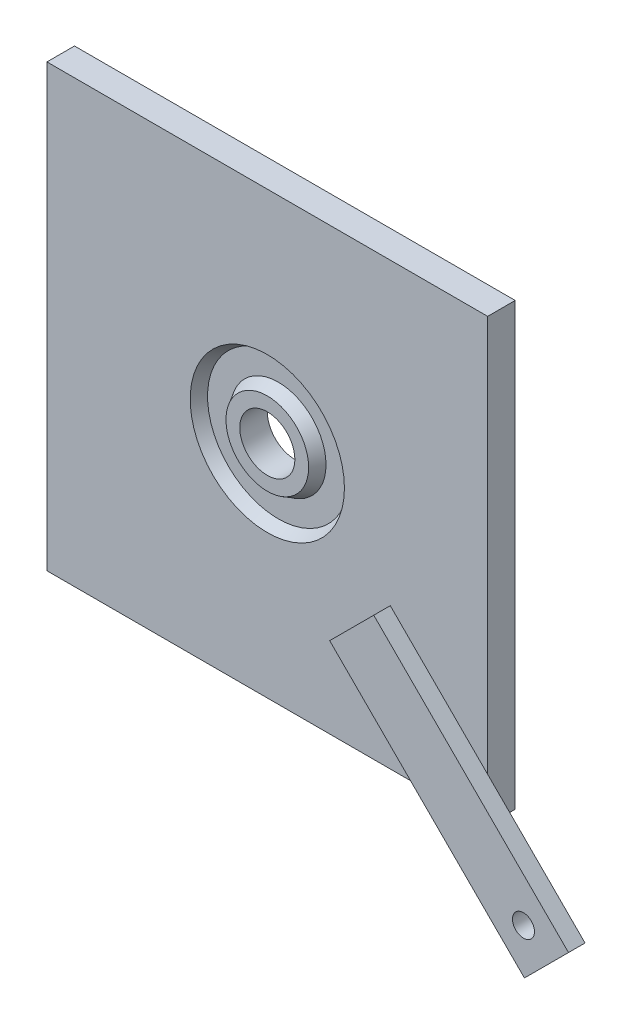
ISO-10303-21;
HEADER;
FILE_DESCRIPTION(('STEP AP214'),'2;1');
FILE_NAME('part.step','',(''),(''),'','','');
FILE_SCHEMA(('AUTOMOTIVE_DESIGN { 1 0 10303 214 1 1 1 1 }'));
ENDSEC;
DATA;
#1=APPLICATION_CONTEXT('core data for automotive mechanical design processes');
#2=APPLICATION_PROTOCOL_DEFINITION('international standard','automotive_design',2000,#1);
#3=PRODUCT_CONTEXT('',#1,'mechanical');
#4=PRODUCT('Part','Part','',(#3));
#5=PRODUCT_RELATED_PRODUCT_CATEGORY('part','',(#4));
#6=PRODUCT_DEFINITION_FORMATION('','',#4);
#7=PRODUCT_DEFINITION_CONTEXT('part definition',#1,'design');
#8=PRODUCT_DEFINITION('design','',#6,#7);
#9=PRODUCT_DEFINITION_SHAPE('','',#8);
#10=(LENGTH_UNIT() NAMED_UNIT(*) SI_UNIT(.MILLI.,.METRE.));
#11=(NAMED_UNIT(*) PLANE_ANGLE_UNIT() SI_UNIT($,.RADIAN.));
#12=(NAMED_UNIT(*) SI_UNIT($,.STERADIAN.) SOLID_ANGLE_UNIT());
#13=UNCERTAINTY_MEASURE_WITH_UNIT(LENGTH_MEASURE(1.E-05),#10,'distance_accuracy_value','');
#14=(GEOMETRIC_REPRESENTATION_CONTEXT(3) GLOBAL_UNCERTAINTY_ASSIGNED_CONTEXT((#13)) GLOBAL_UNIT_ASSIGNED_CONTEXT((#10,
#11,#12)) REPRESENTATION_CONTEXT('',''));
#15=CARTESIAN_POINT('',(0.,0.,0.));
#16=DIRECTION('',(0.,0.,1.));
#17=DIRECTION('',(1.,0.,0.));
#18=AXIS2_PLACEMENT_3D('',#15,#16,#17);
#19=CARTESIAN_POINT('',(0.,0.,5.));
#20=DIRECTION('',(0.,0.,-1.));
#21=DIRECTION('',(-1.,0.,0.));
#22=AXIS2_PLACEMENT_3D('',#19,#20,#21);
#23=PLANE('',#22);
#24=CARTESIAN_POINT('',(0.,0.,5.));
#25=DIRECTION('',(0.,0.,1.));
#26=DIRECTION('',(1.,0.,0.));
#27=AXIS2_PLACEMENT_3D('',#24,#25,#26);
#28=CIRCLE('',#27,14.);
#29=CARTESIAN_POINT('',(14.,0.,5.));
#30=VERTEX_POINT('',#29);
#31=EDGE_CURVE('E146',#30,#30,#28,.T.);
#32=ORIENTED_EDGE('',*,*,#31,.F.);
#33=EDGE_LOOP('',(#32));
#34=FACE_BOUND('',#33,.T.);
#35=DIRECTION('',(-0.707106781186552,0.707106781186543,0.));
#36=VECTOR('',#35,1.);
#37=CARTESIAN_POINT('',(57.6776695296637,-49.6776695296636,5.));
#38=LINE('',#37,#36);
#39=CARTESIAN_POINT('',(40.,-32.0000000000001,5.));
#40=VERTEX_POINT('',#39);
#41=CARTESIAN_POINT('',(22.3223304703361,-14.3223304703365,5.));
#42=VERTEX_POINT('',#41);
#43=EDGE_CURVE('E11',#40,#42,#38,.T.);
#44=ORIENTED_EDGE('',*,*,#43,.F.);
#45=DIRECTION('',(0.,1.,0.));
#46=VECTOR('',#45,1.);
#47=CARTESIAN_POINT('',(40.,-40.,5.));
#48=LINE('',#47,#46);
#49=CARTESIAN_POINT('',(40.,40.,5.));
#50=VERTEX_POINT('',#49);
#51=EDGE_CURVE('E171',#40,#50,#48,.T.);
#52=ORIENTED_EDGE('',*,*,#51,.T.);
#53=DIRECTION('',(-1.,0.,0.));
#54=VECTOR('',#53,1.);
#55=CARTESIAN_POINT('',(-40.,40.,5.));
#56=LINE('',#55,#54);
#57=CARTESIAN_POINT('',(-40.,40.,5.));
#58=VERTEX_POINT('',#57);
#59=EDGE_CURVE('E170',#50,#58,#56,.T.);
#60=ORIENTED_EDGE('',*,*,#59,.T.);
#61=DIRECTION('',(0.,-1.,0.));
#62=VECTOR('',#61,1.);
#63=CARTESIAN_POINT('',(-40.,-40.,5.));
#64=LINE('',#63,#62);
#65=CARTESIAN_POINT('',(-40.,-40.,5.));
#66=VERTEX_POINT('',#65);
#67=EDGE_CURVE('E174',#58,#66,#64,.T.);
#68=ORIENTED_EDGE('',*,*,#67,.T.);
#69=DIRECTION('',(1.,0.,0.));
#70=VECTOR('',#69,1.);
#71=CARTESIAN_POINT('',(-40.,-40.,5.));
#72=LINE('',#71,#70);
#73=CARTESIAN_POINT('',(32.,-40.,5.));
#74=VERTEX_POINT('',#73);
#75=EDGE_CURVE('E178',#66,#74,#72,.T.);
#76=ORIENTED_EDGE('',*,*,#75,.T.);
#77=DIRECTION('',(0.707106781186552,-0.707106781186543,0.));
#78=VECTOR('',#77,1.);
#79=CARTESIAN_POINT('',(49.6776695296638,-57.6776695296636,5.));
#80=LINE('',#79,#78);
#81=CARTESIAN_POINT('',(14.3223304703362,-22.3223304703365,5.));
#82=VERTEX_POINT('',#81);
#83=EDGE_CURVE('E61',#82,#74,#80,.T.);
#84=ORIENTED_EDGE('',*,*,#83,.F.);
#85=DIRECTION('',(-0.707106781186543,-0.707106781186552,0.));
#86=VECTOR('',#85,1.);
#87=CARTESIAN_POINT('',(14.3223304703362,-22.3223304703365,5.));
#88=LINE('',#87,#86);
#89=EDGE_CURVE('E57',#42,#82,#88,.T.);
#90=ORIENTED_EDGE('',*,*,#89,.F.);
#91=EDGE_LOOP('',(#44,#52,#60,#68,#76,#84,#90));
#92=FACE_BOUND('',#91,.T.);
#93=ADVANCED_FACE('F39',(#34,#92),#23,.F.);
#94=CARTESIAN_POINT('',(0.,0.,5.));
#95=DIRECTION('',(0.,0.,1.));
#96=DIRECTION('',(1.,0.,0.));
#97=AXIS2_PLACEMENT_3D('',#94,#95,#96);
#98=CIRCLE('',#97,5.);
#99=CARTESIAN_POINT('',(4.99999999999999,0.,5.));
#100=VERTEX_POINT('',#99);
#101=EDGE_CURVE('E158',#100,#100,#98,.T.);
#102=ORIENTED_EDGE('',*,*,#101,.F.);
#103=EDGE_LOOP('',(#102));
#104=FACE_BOUND('',#103,.T.);
#105=CARTESIAN_POINT('',(0.,0.,5.));
#106=DIRECTION('',(0.,0.,1.));
#107=DIRECTION('',(1.,0.,0.));
#108=AXIS2_PLACEMENT_3D('',#105,#106,#107);
#109=CIRCLE('',#108,7.5);
#110=CARTESIAN_POINT('',(7.5,0.,5.));
#111=VERTEX_POINT('',#110);
#112=EDGE_CURVE('E135',#111,#111,#109,.T.);
#113=ORIENTED_EDGE('',*,*,#112,.T.);
#114=EDGE_LOOP('',(#113));
#115=FACE_BOUND('',#114,.T.);
#116=ADVANCED_FACE('F284',(#104,#115),#23,.F.);
#117=CARTESIAN_POINT('',(0.,0.,0.));
#118=DIRECTION('',(0.,0.,-1.));
#119=DIRECTION('',(-1.,0.,0.));
#120=AXIS2_PLACEMENT_3D('',#117,#118,#119);
#121=PLANE('',#120);
#122=DIRECTION('',(0.,1.,0.));
#123=VECTOR('',#122,1.);
#124=CARTESIAN_POINT('',(40.,-40.,0.));
#125=LINE('',#124,#123);
#126=CARTESIAN_POINT('',(40.,-40.,0.));
#127=VERTEX_POINT('',#126);
#128=CARTESIAN_POINT('',(40.,40.,0.));
#129=VERTEX_POINT('',#128);
#130=EDGE_CURVE('E162',#127,#129,#125,.T.);
#131=ORIENTED_EDGE('',*,*,#130,.F.);
#132=DIRECTION('',(1.,0.,0.));
#133=VECTOR('',#132,1.);
#134=CARTESIAN_POINT('',(-40.,-40.,0.));
#135=LINE('',#134,#133);
#136=CARTESIAN_POINT('',(-40.,-40.,0.));
#137=VERTEX_POINT('',#136);
#138=EDGE_CURVE('E191',#137,#127,#135,.T.);
#139=ORIENTED_EDGE('',*,*,#138,.F.);
#140=DIRECTION('',(0.,-1.,0.));
#141=VECTOR('',#140,1.);
#142=CARTESIAN_POINT('',(-40.,-40.,0.));
#143=LINE('',#142,#141);
#144=CARTESIAN_POINT('',(-40.,40.,0.));
#145=VERTEX_POINT('',#144);
#146=EDGE_CURVE('E188',#145,#137,#143,.T.);
#147=ORIENTED_EDGE('',*,*,#146,.F.);
#148=DIRECTION('',(-1.,0.,0.));
#149=VECTOR('',#148,1.);
#150=CARTESIAN_POINT('',(-40.,40.,0.));
#151=LINE('',#150,#149);
#152=EDGE_CURVE('E185',#129,#145,#151,.T.);
#153=ORIENTED_EDGE('',*,*,#152,.F.);
#154=EDGE_LOOP('',(#131,#139,#147,#153));
#155=FACE_BOUND('',#154,.T.);
#156=CARTESIAN_POINT('',(0.,0.,0.));
#157=DIRECTION('',(0.,0.,1.));
#158=DIRECTION('',(1.,0.,0.));
#159=AXIS2_PLACEMENT_3D('',#156,#157,#158);
#160=CIRCLE('',#159,5.);
#161=CARTESIAN_POINT('',(4.99999999999999,0.,0.));
#162=VERTEX_POINT('',#161);
#163=EDGE_CURVE('E157',#162,#162,#160,.T.);
#164=ORIENTED_EDGE('',*,*,#163,.T.);
#165=EDGE_LOOP('',(#164));
#166=FACE_BOUND('',#165,.T.);
#167=ADVANCED_FACE('F219',(#155,#166),#121,.T.);
#168=CARTESIAN_POINT('',(40.,-40.,5.));
#169=DIRECTION('',(-1.,0.,0.));
#170=DIRECTION('',(0.,0.,1.));
#171=AXIS2_PLACEMENT_3D('',#168,#169,#170);
#172=PLANE('',#171);
#173=ORIENTED_EDGE('',*,*,#130,.T.);
#174=DIRECTION('',(0.,0.,-1.));
#175=VECTOR('',#174,1.);
#176=CARTESIAN_POINT('',(40.,40.,5.));
#177=LINE('',#176,#175);
#178=EDGE_CURVE('E43',#50,#129,#177,.T.);
#179=ORIENTED_EDGE('',*,*,#178,.F.);
#180=ORIENTED_EDGE('',*,*,#51,.F.);
#181=CARTESIAN_POINT('',(40.,-40.,5.));
#182=VERTEX_POINT('',#181);
#183=EDGE_CURVE('E166',#182,#40,#48,.T.);
#184=ORIENTED_EDGE('',*,*,#183,.F.);
#185=DIRECTION('',(0.,0.,-1.));
#186=VECTOR('',#185,1.);
#187=CARTESIAN_POINT('',(40.,-40.,5.));
#188=LINE('',#187,#186);
#189=EDGE_CURVE('E181',#182,#127,#188,.T.);
#190=ORIENTED_EDGE('',*,*,#189,.T.);
#191=EDGE_LOOP('',(#173,#179,#180,#184,#190));
#192=FACE_BOUND('',#191,.T.);
#193=ADVANCED_FACE('F41',(#192),#172,.F.);
#194=CARTESIAN_POINT('',(-40.,40.,5.));
#195=DIRECTION('',(0.,-1.,0.));
#196=DIRECTION('',(0.,0.,-1.));
#197=AXIS2_PLACEMENT_3D('',#194,#195,#196);
#198=PLANE('',#197);
#199=ORIENTED_EDGE('',*,*,#152,.T.);
#200=DIRECTION('',(0.,0.,-1.));
#201=VECTOR('',#200,1.);
#202=CARTESIAN_POINT('',(-40.,40.,5.));
#203=LINE('',#202,#201);
#204=EDGE_CURVE('E200',#58,#145,#203,.T.);
#205=ORIENTED_EDGE('',*,*,#204,.F.);
#206=ORIENTED_EDGE('',*,*,#59,.F.);
#207=ORIENTED_EDGE('',*,*,#178,.T.);
#208=EDGE_LOOP('',(#199,#205,#206,#207));
#209=FACE_BOUND('',#208,.T.);
#210=ADVANCED_FACE('F212',(#209),#198,.F.);
#211=CARTESIAN_POINT('',(-40.,-40.,5.));
#212=DIRECTION('',(1.,0.,0.));
#213=DIRECTION('',(0.,0.,-1.));
#214=AXIS2_PLACEMENT_3D('',#211,#212,#213);
#215=PLANE('',#214);
#216=ORIENTED_EDGE('',*,*,#146,.T.);
#217=DIRECTION('',(0.,0.,-1.));
#218=VECTOR('',#217,1.);
#219=CARTESIAN_POINT('',(-40.,-40.,5.));
#220=LINE('',#219,#218);
#221=EDGE_CURVE('E197',#66,#137,#220,.T.);
#222=ORIENTED_EDGE('',*,*,#221,.F.);
#223=ORIENTED_EDGE('',*,*,#67,.F.);
#224=ORIENTED_EDGE('',*,*,#204,.T.);
#225=EDGE_LOOP('',(#216,#222,#223,#224));
#226=FACE_BOUND('',#225,.T.);
#227=ADVANCED_FACE('F222',(#226),#215,.F.);
#228=CARTESIAN_POINT('',(-40.,-40.,5.));
#229=DIRECTION('',(0.,1.,0.));
#230=DIRECTION('',(0.,0.,1.));
#231=AXIS2_PLACEMENT_3D('',#228,#229,#230);
#232=PLANE('',#231);
#233=ORIENTED_EDGE('',*,*,#138,.T.);
#234=ORIENTED_EDGE('',*,*,#189,.F.);
#235=EDGE_CURVE('E177',#74,#182,#72,.T.);
#236=ORIENTED_EDGE('',*,*,#235,.F.);
#237=ORIENTED_EDGE('',*,*,#75,.F.);
#238=ORIENTED_EDGE('',*,*,#221,.T.);
#239=EDGE_LOOP('',(#233,#234,#236,#237,#238));
#240=FACE_BOUND('',#239,.T.);
#241=ADVANCED_FACE('F225',(#240),#232,.F.);
#242=CARTESIAN_POINT('',(0.,0.,5.));
#243=DIRECTION('',(0.,0.,-1.));
#244=DIRECTION('',(-1.,0.,0.));
#245=AXIS2_PLACEMENT_3D('',#242,#243,#244);
#246=CYLINDRICAL_SURFACE('',#245,5.);
#247=ORIENTED_EDGE('',*,*,#101,.T.);
#248=EDGE_LOOP('',(#247));
#249=FACE_BOUND('',#248,.T.);
#250=ORIENTED_EDGE('',*,*,#163,.F.);
#251=EDGE_LOOP('',(#250));
#252=FACE_BOUND('',#251,.T.);
#253=ADVANCED_FACE('F294',(#249,#252),#246,.F.);
#254=CARTESIAN_POINT('',(0.,0.,5.));
#255=DIRECTION('',(0.,0.,1.));
#256=DIRECTION('',(1.,0.,0.));
#257=AXIS2_PLACEMENT_3D('',#254,#255,#256);
#258=CONICAL_SURFACE('',#257,14.,0.5235987755983);
#259=CARTESIAN_POINT('',(0.,0.,3.));
#260=DIRECTION('',(0.,0.,1.));
#261=DIRECTION('',(1.,0.,0.));
#262=AXIS2_PLACEMENT_3D('',#259,#260,#261);
#263=CIRCLE('',#262,12.8452994616207);
#264=CARTESIAN_POINT('',(12.8452994616207,0.,3.));
#265=VERTEX_POINT('',#264);
#266=EDGE_CURVE('E150',#265,#265,#263,.T.);
#267=ORIENTED_EDGE('',*,*,#266,.F.);
#268=EDGE_LOOP('',(#267));
#269=FACE_BOUND('',#268,.T.);
#270=ORIENTED_EDGE('',*,*,#31,.T.);
#271=EDGE_LOOP('',(#270));
#272=FACE_BOUND('',#271,.T.);
#273=ADVANCED_FACE('F327',(#269,#272),#258,.F.);
#274=CARTESIAN_POINT('',(0.,0.,3.));
#275=DIRECTION('',(0.,0.,1.));
#276=DIRECTION('',(1.,0.,0.));
#277=AXIS2_PLACEMENT_3D('',#274,#275,#276);
#278=PLANE('',#277);
#279=CARTESIAN_POINT('',(0.,0.,3.));
#280=DIRECTION('',(0.,0.,1.));
#281=DIRECTION('',(1.,0.,0.));
#282=AXIS2_PLACEMENT_3D('',#279,#280,#281);
#283=CIRCLE('',#282,8.65470053837925);
#284=CARTESIAN_POINT('',(8.65470053837925,0.,3.));
#285=VERTEX_POINT('',#284);
#286=EDGE_CURVE('E140',#285,#285,#283,.T.);
#287=ORIENTED_EDGE('',*,*,#286,.F.);
#288=EDGE_LOOP('',(#287));
#289=FACE_BOUND('',#288,.T.);
#290=ORIENTED_EDGE('',*,*,#266,.T.);
#291=EDGE_LOOP('',(#290));
#292=FACE_BOUND('',#291,.T.);
#293=ADVANCED_FACE('F331',(#289,#292),#278,.T.);
#294=CARTESIAN_POINT('',(0.,0.,5.));
#295=DIRECTION('',(0.,0.,-1.));
#296=DIRECTION('',(1.,0.,0.));
#297=AXIS2_PLACEMENT_3D('',#294,#295,#296);
#298=CONICAL_SURFACE('',#297,7.5,0.5235987755983);
#299=ORIENTED_EDGE('',*,*,#286,.T.);
#300=EDGE_LOOP('',(#299));
#301=FACE_BOUND('',#300,.T.);
#302=ORIENTED_EDGE('',*,*,#112,.F.);
#303=EDGE_LOOP('',(#302));
#304=FACE_BOUND('',#303,.T.);
#305=ADVANCED_FACE('F279',(#301,#304),#298,.T.);
#306=CARTESIAN_POINT('',(0.,0.,5.));
#307=DIRECTION('',(0.,0.,1.));
#308=DIRECTION('',(1.,0.,0.));
#309=AXIS2_PLACEMENT_3D('',#306,#307,#308);
#310=PLANE('',#309);
#311=CARTESIAN_POINT('',(49.4974746830584,-49.4974746830583,5.));
#312=DIRECTION('',(0.,0.,1.));
#313=DIRECTION('',(1.,0.,0.));
#314=AXIS2_PLACEMENT_3D('',#311,#312,#313);
#315=CIRCLE('',#314,2.);
#316=CARTESIAN_POINT('',(51.4974746830584,-49.4974746830583,5.));
#317=VERTEX_POINT('',#316);
#318=EDGE_CURVE('E260',#317,#317,#315,.T.);
#319=ORIENTED_EDGE('',*,*,#318,.T.);
#320=EDGE_LOOP('',(#319));
#321=FACE_BOUND('',#320,.T.);
#322=ORIENTED_EDGE('',*,*,#235,.T.);
#323=ORIENTED_EDGE('',*,*,#183,.T.);
#324=CARTESIAN_POINT('',(57.6776695296637,-49.6776695296636,5.));
#325=VERTEX_POINT('',#324);
#326=EDGE_CURVE('E50',#325,#40,#38,.T.);
#327=ORIENTED_EDGE('',*,*,#326,.F.);
#328=DIRECTION('',(0.707106781186543,0.707106781186552,0.));
#329=VECTOR('',#328,1.);
#330=CARTESIAN_POINT('',(49.6776695296638,-57.6776695296636,5.));
#331=LINE('',#330,#329);
#332=CARTESIAN_POINT('',(49.6776695296638,-57.6776695296636,5.));
#333=VERTEX_POINT('',#332);
#334=EDGE_CURVE('E237',#333,#325,#331,.T.);
#335=ORIENTED_EDGE('',*,*,#334,.F.);
#336=EDGE_CURVE('E236',#74,#333,#80,.T.);
#337=ORIENTED_EDGE('',*,*,#336,.F.);
#338=EDGE_LOOP('',(#322,#323,#327,#335,#337));
#339=FACE_BOUND('',#338,.T.);
#340=ADVANCED_FACE('F232',(#321,#339),#310,.F.);
#341=CARTESIAN_POINT('',(0.,0.,8.));
#342=DIRECTION('',(0.,0.,1.));
#343=DIRECTION('',(1.,0.,0.));
#344=AXIS2_PLACEMENT_3D('',#341,#342,#343);
#345=PLANE('',#344);
#346=DIRECTION('',(-0.707106781186543,-0.707106781186552,0.));
#347=VECTOR('',#346,1.);
#348=CARTESIAN_POINT('',(14.3223304703362,-22.3223304703365,8.));
#349=LINE('',#348,#347);
#350=CARTESIAN_POINT('',(22.3223304703361,-14.3223304703365,8.));
#351=VERTEX_POINT('',#350);
#352=CARTESIAN_POINT('',(14.3223304703362,-22.3223304703365,8.));
#353=VERTEX_POINT('',#352);
#354=EDGE_CURVE('E121',#351,#353,#349,.T.);
#355=ORIENTED_EDGE('',*,*,#354,.T.);
#356=DIRECTION('',(0.707106781186552,-0.707106781186543,0.));
#357=VECTOR('',#356,1.);
#358=CARTESIAN_POINT('',(49.6776695296638,-57.6776695296636,8.));
#359=LINE('',#358,#357);
#360=CARTESIAN_POINT('',(49.6776695296638,-57.6776695296636,8.));
#361=VERTEX_POINT('',#360);
#362=EDGE_CURVE('E110',#353,#361,#359,.T.);
#363=ORIENTED_EDGE('',*,*,#362,.T.);
#364=DIRECTION('',(0.707106781186543,0.707106781186552,0.));
#365=VECTOR('',#364,1.);
#366=CARTESIAN_POINT('',(49.6776695296638,-57.6776695296636,8.));
#367=LINE('',#366,#365);
#368=CARTESIAN_POINT('',(57.6776695296637,-49.6776695296636,8.));
#369=VERTEX_POINT('',#368);
#370=EDGE_CURVE('E120',#361,#369,#367,.T.);
#371=ORIENTED_EDGE('',*,*,#370,.T.);
#372=DIRECTION('',(-0.707106781186552,0.707106781186543,0.));
#373=VECTOR('',#372,1.);
#374=CARTESIAN_POINT('',(57.6776695296637,-49.6776695296636,8.));
#375=LINE('',#374,#373);
#376=EDGE_CURVE('E127',#369,#351,#375,.T.);
#377=ORIENTED_EDGE('',*,*,#376,.T.);
#378=EDGE_LOOP('',(#355,#363,#371,#377));
#379=FACE_BOUND('',#378,.T.);
#380=CARTESIAN_POINT('',(49.4974746830584,-49.4974746830583,8.));
#381=DIRECTION('',(0.,0.,1.));
#382=DIRECTION('',(1.,0.,0.));
#383=AXIS2_PLACEMENT_3D('',#380,#381,#382);
#384=CIRCLE('',#383,2.);
#385=CARTESIAN_POINT('',(51.4974746830584,-49.4974746830583,8.));
#386=VERTEX_POINT('',#385);
#387=EDGE_CURVE('E264',#386,#386,#384,.T.);
#388=ORIENTED_EDGE('',*,*,#387,.F.);
#389=EDGE_LOOP('',(#388));
#390=FACE_BOUND('',#389,.T.);
#391=ADVANCED_FACE('F124',(#379,#390),#345,.T.);
#392=CARTESIAN_POINT('',(14.3223304703362,-22.3223304703365,8.));
#393=DIRECTION('',(0.707106781186552,-0.707106781186543,0.));
#394=DIRECTION('',(0.707106781186543,0.707106781186552,0.));
#395=AXIS2_PLACEMENT_3D('',#392,#393,#394);
#396=PLANE('',#395);
#397=ORIENTED_EDGE('',*,*,#89,.T.);
#398=DIRECTION('',(0.,0.,-1.));
#399=VECTOR('',#398,1.);
#400=CARTESIAN_POINT('',(14.3223304703362,-22.3223304703365,8.));
#401=LINE('',#400,#399);
#402=EDGE_CURVE('E114',#353,#82,#401,.T.);
#403=ORIENTED_EDGE('',*,*,#402,.F.);
#404=ORIENTED_EDGE('',*,*,#354,.F.);
#405=DIRECTION('',(0.,0.,-1.));
#406=VECTOR('',#405,1.);
#407=CARTESIAN_POINT('',(22.3223304703361,-14.3223304703365,8.));
#408=LINE('',#407,#406);
#409=EDGE_CURVE('E247',#351,#42,#408,.T.);
#410=ORIENTED_EDGE('',*,*,#409,.T.);
#411=EDGE_LOOP('',(#397,#403,#404,#410));
#412=FACE_BOUND('',#411,.T.);
#413=ADVANCED_FACE('F133',(#412),#396,.F.);
#414=CARTESIAN_POINT('',(49.6776695296638,-57.6776695296636,8.));
#415=DIRECTION('',(0.707106781186543,0.707106781186552,0.));
#416=DIRECTION('',(-0.707106781186552,0.707106781186543,0.));
#417=AXIS2_PLACEMENT_3D('',#414,#415,#416);
#418=PLANE('',#417);
#419=ORIENTED_EDGE('',*,*,#83,.T.);
#420=ORIENTED_EDGE('',*,*,#336,.T.);
#421=DIRECTION('',(0.,0.,-1.));
#422=VECTOR('',#421,1.);
#423=CARTESIAN_POINT('',(49.6776695296638,-57.6776695296636,8.));
#424=LINE('',#423,#422);
#425=EDGE_CURVE('E116',#361,#333,#424,.T.);
#426=ORIENTED_EDGE('',*,*,#425,.F.);
#427=ORIENTED_EDGE('',*,*,#362,.F.);
#428=ORIENTED_EDGE('',*,*,#402,.T.);
#429=EDGE_LOOP('',(#419,#420,#426,#427,#428));
#430=FACE_BOUND('',#429,.T.);
#431=ADVANCED_FACE('F112',(#430),#418,.F.);
#432=CARTESIAN_POINT('',(49.6776695296638,-57.6776695296636,8.));
#433=DIRECTION('',(-0.707106781186552,0.707106781186543,0.));
#434=DIRECTION('',(-0.707106781186543,-0.707106781186552,0.));
#435=AXIS2_PLACEMENT_3D('',#432,#433,#434);
#436=PLANE('',#435);
#437=ORIENTED_EDGE('',*,*,#334,.T.);
#438=DIRECTION('',(0.,0.,-1.));
#439=VECTOR('',#438,1.);
#440=CARTESIAN_POINT('',(57.6776695296637,-49.6776695296636,8.));
#441=LINE('',#440,#439);
#442=EDGE_CURVE('E142',#369,#325,#441,.T.);
#443=ORIENTED_EDGE('',*,*,#442,.F.);
#444=ORIENTED_EDGE('',*,*,#370,.F.);
#445=ORIENTED_EDGE('',*,*,#425,.T.);
#446=EDGE_LOOP('',(#437,#443,#444,#445));
#447=FACE_BOUND('',#446,.T.);
#448=ADVANCED_FACE('F255',(#447),#436,.F.);
#449=CARTESIAN_POINT('',(57.6776695296637,-49.6776695296636,8.));
#450=DIRECTION('',(-0.707106781186543,-0.707106781186552,0.));
#451=DIRECTION('',(0.707106781186552,-0.707106781186543,0.));
#452=AXIS2_PLACEMENT_3D('',#449,#450,#451);
#453=PLANE('',#452);
#454=ORIENTED_EDGE('',*,*,#326,.T.);
#455=ORIENTED_EDGE('',*,*,#43,.T.);
#456=ORIENTED_EDGE('',*,*,#409,.F.);
#457=ORIENTED_EDGE('',*,*,#376,.F.);
#458=ORIENTED_EDGE('',*,*,#442,.T.);
#459=EDGE_LOOP('',(#454,#455,#456,#457,#458));
#460=FACE_BOUND('',#459,.T.);
#461=ADVANCED_FACE('F253',(#460),#453,.F.);
#462=CARTESIAN_POINT('',(49.4974746830584,-49.4974746830583,8.));
#463=DIRECTION('',(0.,0.,-1.));
#464=DIRECTION('',(-1.,0.,0.));
#465=AXIS2_PLACEMENT_3D('',#462,#463,#464);
#466=CYLINDRICAL_SURFACE('',#465,2.);
#467=ORIENTED_EDGE('',*,*,#387,.T.);
#468=EDGE_LOOP('',(#467));
#469=FACE_BOUND('',#468,.T.);
#470=ORIENTED_EDGE('',*,*,#318,.F.);
#471=EDGE_LOOP('',(#470));
#472=FACE_BOUND('',#471,.T.);
#473=ADVANCED_FACE('F270',(#469,#472),#466,.F.);
#474=CLOSED_SHELL('',(#93,#116,#167,#193,#210,#227,#241,#253,#273,#293,#305,#340,#391,#413,#431,
#448,#461,#473));
#475=MANIFOLD_SOLID_BREP('B2',#474);
#476=ADVANCED_BREP_SHAPE_REPRESENTATION('',(#18,#475),#14);
#477=SHAPE_DEFINITION_REPRESENTATION(#9,#476);
ENDSEC;
END-ISO-10303-21;
